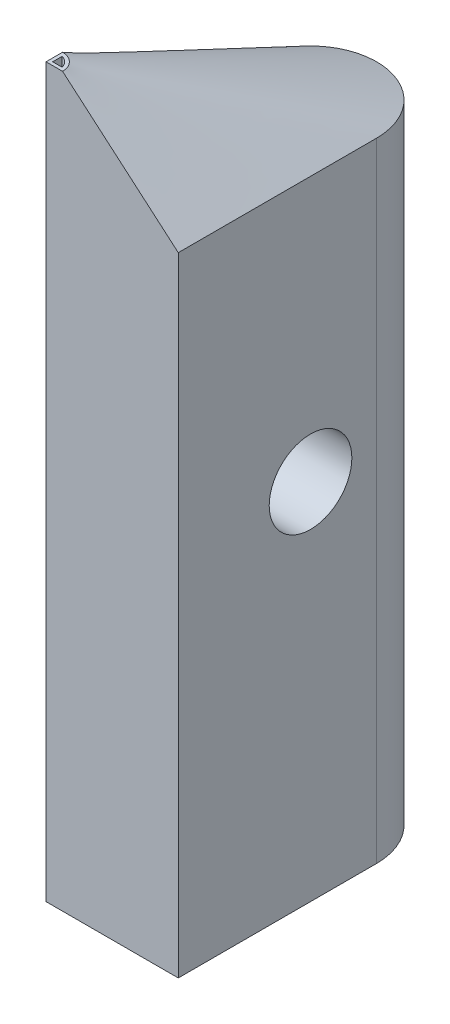
ISO-10303-21;
HEADER;
FILE_DESCRIPTION(('STEP AP214'),'2;1');
FILE_NAME('part.step','',(''),(''),'','','');
FILE_SCHEMA(('AUTOMOTIVE_DESIGN { 1 0 10303 214 1 1 1 1 }'));
ENDSEC;
DATA;
#1=APPLICATION_CONTEXT('core data for automotive mechanical design processes');
#2=APPLICATION_PROTOCOL_DEFINITION('international standard','automotive_design',2000,#1);
#3=PRODUCT_CONTEXT('',#1,'mechanical');
#4=PRODUCT('Part','Part','',(#3));
#5=PRODUCT_RELATED_PRODUCT_CATEGORY('part','',(#4));
#6=PRODUCT_DEFINITION_FORMATION('','',#4);
#7=PRODUCT_DEFINITION_CONTEXT('part definition',#1,'design');
#8=PRODUCT_DEFINITION('design','',#6,#7);
#9=PRODUCT_DEFINITION_SHAPE('','',#8);
#10=(LENGTH_UNIT() NAMED_UNIT(*) SI_UNIT(.MILLI.,.METRE.));
#11=(NAMED_UNIT(*) PLANE_ANGLE_UNIT() SI_UNIT($,.RADIAN.));
#12=(NAMED_UNIT(*) SI_UNIT($,.STERADIAN.) SOLID_ANGLE_UNIT());
#13=UNCERTAINTY_MEASURE_WITH_UNIT(LENGTH_MEASURE(1.E-05),#10,'distance_accuracy_value','');
#14=(GEOMETRIC_REPRESENTATION_CONTEXT(3) GLOBAL_UNCERTAINTY_ASSIGNED_CONTEXT((#13)) GLOBAL_UNIT_ASSIGNED_CONTEXT((#10,
#11,#12)) REPRESENTATION_CONTEXT('',''));
#15=CARTESIAN_POINT('',(0.,0.,0.));
#16=DIRECTION('',(0.,0.,1.));
#17=DIRECTION('',(1.,0.,0.));
#18=AXIS2_PLACEMENT_3D('',#15,#16,#17);
#19=CARTESIAN_POINT('',(-20.,170.,60.));
#20=DIRECTION('',(0.,-1.,0.));
#21=DIRECTION('',(0.,0.,-1.));
#22=AXIS2_PLACEMENT_3D('',#19,#20,#21);
#23=PLANE('',#22);
#24=DIRECTION('',(0.,0.,-1.));
#25=VECTOR('',#24,1.);
#26=CARTESIAN_POINT('',(-20.,170.,60.));
#27=LINE('',#26,#25);
#28=CARTESIAN_POINT('',(-20.,170.,60.));
#29=VERTEX_POINT('',#28);
#30=CARTESIAN_POINT('',(-20.,170.,55.));
#31=VERTEX_POINT('',#30);
#32=EDGE_CURVE('E273',#29,#31,#27,.T.);
#33=ORIENTED_EDGE('',*,*,#32,.F.);
#34=DIRECTION('',(1.,0.,0.));
#35=VECTOR('',#34,1.);
#36=CARTESIAN_POINT('',(-20.,170.,60.));
#37=LINE('',#36,#35);
#38=CARTESIAN_POINT('',(-15.,170.,60.));
#39=VERTEX_POINT('',#38);
#40=EDGE_CURVE('E147',#29,#39,#37,.T.);
#41=ORIENTED_EDGE('',*,*,#40,.T.);
#42=CARTESIAN_POINT('',(-20.,170.,60.));
#43=DIRECTION('',(0.,-1.,0.));
#44=DIRECTION('',(0.,0.,-1.));
#45=AXIS2_PLACEMENT_3D('',#42,#43,#44);
#46=CIRCLE('',#45,5.);
#47=CARTESIAN_POINT('',(-15.9549150281253,170.,57.0610737385376));
#48=VERTEX_POINT('',#47);
#49=EDGE_CURVE('E260',#48,#39,#46,.T.);
#50=ORIENTED_EDGE('',*,*,#49,.F.);
#51=EDGE_CURVE('E261',#31,#48,#46,.T.);
#52=ORIENTED_EDGE('',*,*,#51,.F.);
#53=EDGE_LOOP('',(#33,#41,#50,#52));
#54=FACE_BOUND('',#53,.T.);
#55=DIRECTION('',(0.,0.,-1.));
#56=VECTOR('',#55,1.);
#57=CARTESIAN_POINT('',(-19.,170.,0.));
#58=LINE('',#57,#56);
#59=CARTESIAN_POINT('',(-19.,170.,59.));
#60=VERTEX_POINT('',#59);
#61=CARTESIAN_POINT('',(-19.,170.,56.1270166537926));
#62=VERTEX_POINT('',#61);
#63=EDGE_CURVE('E93',#60,#62,#58,.T.);
#64=ORIENTED_EDGE('',*,*,#63,.T.);
#65=CARTESIAN_POINT('',(-20.,170.,60.));
#66=DIRECTION('',(0.,-1.,0.));
#67=DIRECTION('',(0.,0.,-1.));
#68=AXIS2_PLACEMENT_3D('',#65,#66,#67);
#69=CIRCLE('',#68,4.);
#70=CARTESIAN_POINT('',(-16.1270166537926,170.,59.));
#71=VERTEX_POINT('',#70);
#72=EDGE_CURVE('E332',#62,#71,#69,.T.);
#73=ORIENTED_EDGE('',*,*,#72,.T.);
#74=DIRECTION('',(1.,0.,0.));
#75=VECTOR('',#74,1.);
#76=CARTESIAN_POINT('',(0.,170.,59.));
#77=LINE('',#76,#75);
#78=EDGE_CURVE('E328',#60,#71,#77,.T.);
#79=ORIENTED_EDGE('',*,*,#78,.F.);
#80=EDGE_LOOP('',(#64,#73,#79));
#81=FACE_BOUND('',#80,.T.);
#82=ADVANCED_FACE('F75',(#54,#81),#23,.F.);
#83=CARTESIAN_POINT('',(0.,-50.,0.));
#84=DIRECTION('',(0.,1.,0.));
#85=DIRECTION('',(0.,0.,1.));
#86=AXIS2_PLACEMENT_3D('',#83,#84,#85);
#87=CYLINDRICAL_SURFACE('',#86,20.);
#88=DIRECTION('',(0.,1.,0.));
#89=VECTOR('',#88,1.);
#90=CARTESIAN_POINT('',(-20.,-50.,0.));
#91=LINE('',#90,#89);
#92=CARTESIAN_POINT('',(-20.,-50.,0.));
#93=VERTEX_POINT('',#92);
#94=CARTESIAN_POINT('',(-20.,140.,0.));
#95=VERTEX_POINT('',#94);
#96=EDGE_CURVE('E122',#93,#95,#91,.T.);
#97=ORIENTED_EDGE('',*,*,#96,.T.);
#98=CARTESIAN_POINT('',(20.,140.,60.));
#99=CARTESIAN_POINT('',(20.,140.,55.4019407833369));
#100=CARTESIAN_POINT('',(20.,140.,45.6811972447143));
#101=CARTESIAN_POINT('',(20.,140.,30.));
#102=CARTESIAN_POINT('',(20.,140.,14.3188027552857));
#103=CARTESIAN_POINT('',(20.,140.,4.59805921666312));
#104=CARTESIAN_POINT('',(20.,140.,-2.81896424716483));
#105=CARTESIAN_POINT('',(18.8035920170639,140.,-8.27180270953886));
#106=CARTESIAN_POINT('',(14.170791174395,140.,-14.8236236418117));
#107=CARTESIAN_POINT('',(7.58359128178384,140.,-19.0344797939609));
#108=CARTESIAN_POINT('',(0.,139.999999999999,-20.4832389037656));
#109=CARTESIAN_POINT('',(-7.58359128178385,140.,-19.034479793961));
#110=CARTESIAN_POINT('',(-14.170791174395,140.,-14.8236236418116));
#111=CARTESIAN_POINT('',(-18.8035920170639,140.,-8.27180270953888));
#112=CARTESIAN_POINT('',(-20.,140.,-2.81896424716483));
#113=CARTESIAN_POINT('',(-20.,140.,0.));
#114=B_SPLINE_CURVE_WITH_KNOTS('',3,(#98,#99,#100,#101,#102,#103,#104,#105,#106,#107,#108,#109,
#110,#111,#112,#113),.UNSPECIFIED.,.F.,.F.,(4,1,1,1,2,1,1,1,1,1,1,1,4),(0.,0.1123013070716,
0.224602614143199,0.336903921214799,0.449205228286398,0.518054574750598,0.586903921214799,
0.655753267678999,0.724602614143199,0.7934519606074,0.8623013070716,0.9311506535358,1.),.UNSPECIFIED.);
#115=CARTESIAN_POINT('',(20.,140.,0.));
#116=VERTEX_POINT('',#115);
#117=EDGE_CURVE('E158',#116,#95,#114,.T.);
#118=ORIENTED_EDGE('',*,*,#117,.F.);
#119=DIRECTION('',(0.,1.,0.));
#120=VECTOR('',#119,1.);
#121=CARTESIAN_POINT('',(20.,-50.,0.));
#122=LINE('',#121,#120);
#123=CARTESIAN_POINT('',(20.,-50.,0.));
#124=VERTEX_POINT('',#123);
#125=EDGE_CURVE('E12',#124,#116,#122,.T.);
#126=ORIENTED_EDGE('',*,*,#125,.F.);
#127=CARTESIAN_POINT('',(0.,-50.,0.));
#128=DIRECTION('',(0.,1.,0.));
#129=DIRECTION('',(0.,0.,-1.));
#130=AXIS2_PLACEMENT_3D('',#127,#128,#129);
#131=CIRCLE('',#130,20.);
#132=EDGE_CURVE('E143',#124,#93,#131,.T.);
#133=ORIENTED_EDGE('',*,*,#132,.T.);
#134=EDGE_LOOP('',(#97,#118,#126,#133));
#135=FACE_BOUND('',#134,.T.);
#136=ADVANCED_FACE('F77',(#135),#87,.T.);
#137=CARTESIAN_POINT('',(20.,-50.,20.));
#138=DIRECTION('',(1.,0.,0.));
#139=DIRECTION('',(0.,0.,-1.));
#140=AXIS2_PLACEMENT_3D('',#137,#138,#139);
#141=PLANE('',#140);
#142=CARTESIAN_POINT('',(20.,60.,20.));
#143=DIRECTION('',(1.,0.,0.));
#144=DIRECTION('',(0.,0.,-1.));
#145=AXIS2_PLACEMENT_3D('',#142,#143,#144);
#146=CIRCLE('',#145,12.5);
#147=CARTESIAN_POINT('',(20.,60.,7.50000000000001));
#148=VERTEX_POINT('',#147);
#149=EDGE_CURVE('E204',#148,#148,#146,.F.);
#150=ORIENTED_EDGE('',*,*,#149,.T.);
#151=EDGE_LOOP('',(#150));
#152=FACE_BOUND('',#151,.T.);
#153=ORIENTED_EDGE('',*,*,#125,.T.);
#154=DIRECTION('',(0.,0.,-1.));
#155=VECTOR('',#154,1.);
#156=CARTESIAN_POINT('',(20.,140.,20.));
#157=LINE('',#156,#155);
#158=CARTESIAN_POINT('',(20.,140.,60.));
#159=VERTEX_POINT('',#158);
#160=EDGE_CURVE('E195',#159,#116,#157,.T.);
#161=ORIENTED_EDGE('',*,*,#160,.F.);
#162=DIRECTION('',(0.,1.,0.));
#163=VECTOR('',#162,1.);
#164=CARTESIAN_POINT('',(20.,-50.,60.));
#165=LINE('',#164,#163);
#166=CARTESIAN_POINT('',(20.,-50.,60.));
#167=VERTEX_POINT('',#166);
#168=EDGE_CURVE('E85',#167,#159,#165,.T.);
#169=ORIENTED_EDGE('',*,*,#168,.F.);
#170=DIRECTION('',(0.,0.,-1.));
#171=VECTOR('',#170,1.);
#172=CARTESIAN_POINT('',(20.,-50.,60.));
#173=LINE('',#172,#171);
#174=EDGE_CURVE('E101',#167,#124,#173,.T.);
#175=ORIENTED_EDGE('',*,*,#174,.T.);
#176=EDGE_LOOP('',(#153,#161,#169,#175));
#177=FACE_BOUND('',#176,.T.);
#178=ADVANCED_FACE('F188',(#152,#177),#141,.T.);
#179=CARTESIAN_POINT('',(-20.,-50.,60.));
#180=DIRECTION('',(0.,0.,1.));
#181=DIRECTION('',(1.,0.,0.));
#182=AXIS2_PLACEMENT_3D('',#179,#180,#181);
#183=PLANE('',#182);
#184=ORIENTED_EDGE('',*,*,#168,.T.);
#185=DIRECTION('',(-0.759256602365297,0.650791373455968,0.));
#186=VECTOR('',#185,1.);
#187=CARTESIAN_POINT('',(2.5,155.,60.));
#188=LINE('',#187,#186);
#189=EDGE_CURVE('E279',#159,#39,#188,.T.);
#190=ORIENTED_EDGE('',*,*,#189,.T.);
#191=ORIENTED_EDGE('',*,*,#40,.F.);
#192=DIRECTION('',(0.,1.,0.));
#193=VECTOR('',#192,1.);
#194=CARTESIAN_POINT('',(-20.,-50.,60.));
#195=LINE('',#194,#193);
#196=CARTESIAN_POINT('',(-20.,-50.,60.));
#197=VERTEX_POINT('',#196);
#198=EDGE_CURVE('E136',#197,#29,#195,.T.);
#199=ORIENTED_EDGE('',*,*,#198,.F.);
#200=DIRECTION('',(1.,0.,0.));
#201=VECTOR('',#200,1.);
#202=CARTESIAN_POINT('',(-20.,-50.,60.));
#203=LINE('',#202,#201);
#204=EDGE_CURVE('E142',#197,#167,#203,.T.);
#205=ORIENTED_EDGE('',*,*,#204,.T.);
#206=EDGE_LOOP('',(#184,#190,#191,#199,#205));
#207=FACE_BOUND('',#206,.T.);
#208=ADVANCED_FACE('F145',(#207),#183,.T.);
#209=CARTESIAN_POINT('',(-20.,-50.,20.));
#210=DIRECTION('',(-1.,0.,0.));
#211=DIRECTION('',(0.,0.,1.));
#212=AXIS2_PLACEMENT_3D('',#209,#210,#211);
#213=PLANE('',#212);
#214=CARTESIAN_POINT('',(-20.,60.,20.));
#215=DIRECTION('',(-1.,0.,0.));
#216=DIRECTION('',(0.,0.,1.));
#217=AXIS2_PLACEMENT_3D('',#214,#215,#216);
#218=CIRCLE('',#217,12.5);
#219=CARTESIAN_POINT('',(-20.,60.,32.5));
#220=VERTEX_POINT('',#219);
#221=EDGE_CURVE('E208',#220,#220,#218,.T.);
#222=ORIENTED_EDGE('',*,*,#221,.F.);
#223=EDGE_LOOP('',(#222));
#224=FACE_BOUND('',#223,.T.);
#225=ORIENTED_EDGE('',*,*,#198,.T.);
#226=ORIENTED_EDGE('',*,*,#32,.T.);
#227=DIRECTION('',(0.,0.478852130680573,0.877895572914385));
#228=VECTOR('',#227,1.);
#229=CARTESIAN_POINT('',(-20.,155.,27.5));
#230=LINE('',#229,#228);
#231=EDGE_CURVE('E278',#95,#31,#230,.T.);
#232=ORIENTED_EDGE('',*,*,#231,.F.);
#233=ORIENTED_EDGE('',*,*,#96,.F.);
#234=DIRECTION('',(0.,0.,1.));
#235=VECTOR('',#234,1.);
#236=CARTESIAN_POINT('',(-20.,-50.,0.));
#237=LINE('',#236,#235);
#238=EDGE_CURVE('E132',#93,#197,#237,.T.);
#239=ORIENTED_EDGE('',*,*,#238,.T.);
#240=EDGE_LOOP('',(#225,#226,#232,#233,#239));
#241=FACE_BOUND('',#240,.T.);
#242=ADVANCED_FACE('F134',(#224,#241),#213,.T.);
#243=CARTESIAN_POINT('',(0.,-50.,0.));
#244=DIRECTION('',(0.,-1.,0.));
#245=DIRECTION('',(0.,0.,-1.));
#246=AXIS2_PLACEMENT_3D('',#243,#244,#245);
#247=PLANE('',#246);
#248=ORIENTED_EDGE('',*,*,#132,.F.);
#249=ORIENTED_EDGE('',*,*,#174,.F.);
#250=ORIENTED_EDGE('',*,*,#204,.F.);
#251=ORIENTED_EDGE('',*,*,#238,.F.);
#252=EDGE_LOOP('',(#248,#249,#250,#251));
#253=FACE_BOUND('',#252,.T.);
#254=ADVANCED_FACE('F151',(#253),#247,.T.);
#255=CARTESIAN_POINT('',(55.3553390593274,60.,20.));
#256=DIRECTION('',(-1.,0.,0.));
#257=DIRECTION('',(0.,0.,1.));
#258=AXIS2_PLACEMENT_3D('',#255,#256,#257);
#259=CYLINDRICAL_SURFACE('',#258,12.5);
#260=ORIENTED_EDGE('',*,*,#221,.T.);
#261=EDGE_LOOP('',(#260));
#262=FACE_BOUND('',#261,.T.);
#263=ORIENTED_EDGE('',*,*,#149,.F.);
#264=EDGE_LOOP('',(#263));
#265=FACE_BOUND('',#264,.T.);
#266=ADVANCED_FACE('F235',(#262,#265),#259,.F.);
#267=CARTESIAN_POINT('',(20.,140.,60.));
#268=CARTESIAN_POINT('',(-15.,170.,60.));
#269=CARTESIAN_POINT('',(20.,140.,55.4019407833369));
#270=CARTESIAN_POINT('',(-15.,170.,59.7059958680896));
#271=CARTESIAN_POINT('',(20.,140.,45.6811972447143));
#272=CARTESIAN_POINT('',(-15.0495267687466,170.,59.1746297244077));
#273=CARTESIAN_POINT('',(20.,140.,30.));
#274=CARTESIAN_POINT('',(-15.2271344449601,170.,58.4492019736959));
#275=CARTESIAN_POINT('',(20.,140.,14.3188027552857));
#276=CARTESIAN_POINT('',(-15.509842550044,170.,57.7579234224067));
#277=CARTESIAN_POINT('',(20.,140.,4.59805921666312));
#278=CARTESIAN_POINT('',(-15.7821037352753,170.,57.2989280776695));
#279=CARTESIAN_POINT('',(20.,140.,-2.81896424716483));
#280=CARTESIAN_POINT('',(-16.0608616541299,170.,56.91525071797));
#281=CARTESIAN_POINT('',(18.8035920170639,140.,-8.27180270953886));
#282=CARTESIAN_POINT('',(-16.2949448790564,170.,56.626492280199));
#283=CARTESIAN_POINT('',(14.170791174395,140.,-14.8236236418117));
#284=CARTESIAN_POINT('',(-16.7116021654231,170.,56.2174361013872));
#285=CARTESIAN_POINT('',(7.58359128178384,140.,-19.0344797939609));
#286=CARTESIAN_POINT('',(-17.1927544309923,170.,55.8478800681714));
#287=CARTESIAN_POINT('',(0.,139.999999999999,-20.4832389037656));
#288=CARTESIAN_POINT('',(-17.7239961902029,170.,55.5330910123224));
#289=CARTESIAN_POINT('',(-7.58359128178385,140.,-19.034479793961));
#290=CARTESIAN_POINT('',(-18.2909219574939,170.,55.2883357656105));
#291=CARTESIAN_POINT('',(-14.170791174395,140.,-14.8236236418116));
#292=CARTESIAN_POINT('',(-18.8727132745479,170.,55.116294992103));
#293=CARTESIAN_POINT('',(-18.8035920170639,140.,-8.27180270953888));
#294=CARTESIAN_POINT('',(-19.4485516830473,170.,55.0196493558668));
#295=CARTESIAN_POINT('',(-20.,140.,-2.81896424716483));
#296=CARTESIAN_POINT('',(-19.819752833894,170.,55.));
#297=CARTESIAN_POINT('',(-20.,140.,0.));
#298=CARTESIAN_POINT('',(-20.,170.,55.));
#299=B_SPLINE_SURFACE_WITH_KNOTS('',3,1,((#267,#268),(#269,#270),(#271,#272),(#273,#274),(#275,
#276),(#277,#278),(#279,#280),(#281,#282),(#283,#284),(#285,#286),(#287,#288),(#289,#290),(#291,
#292),(#293,#294),(#295,#296),(#297,#298)),.UNSPECIFIED.,.F.,.F.,.F.,(4,1,1,1,2,1,1,1,1,1,1,1,
4),(2,2),(0.,0.1123013070716,0.224602614143199,0.336903921214799,0.449205228286398,
0.518054574750598,0.586903921214799,0.655753267678999,0.724602614143199,0.7934519606074,
0.8623013070716,0.9311506535358,1.),(0.,1.),.UNSPECIFIED.);
#300=ORIENTED_EDGE('',*,*,#160,.T.);
#301=ORIENTED_EDGE('',*,*,#117,.T.);
#302=ORIENTED_EDGE('',*,*,#231,.T.);
#303=ORIENTED_EDGE('',*,*,#51,.T.);
#304=ORIENTED_EDGE('',*,*,#49,.T.);
#305=ORIENTED_EDGE('',*,*,#189,.F.);
#306=EDGE_LOOP('',(#300,#301,#302,#303,#304,#305));
#307=FACE_BOUND('',#306,.T.);
#308=ADVANCED_FACE('F230',(#307),#299,.T.);
#309=CARTESIAN_POINT('',(-19.,165.,0.));
#310=DIRECTION('',(1.,0.,0.));
#311=DIRECTION('',(0.,0.,-1.));
#312=AXIS2_PLACEMENT_3D('',#309,#310,#311);
#313=PLANE('',#312);
#314=ORIENTED_EDGE('',*,*,#63,.F.);
#315=DIRECTION('',(0.,1.,0.));
#316=VECTOR('',#315,1.);
#317=CARTESIAN_POINT('',(-19.,165.,59.));
#318=LINE('',#317,#316);
#319=CARTESIAN_POINT('',(-19.,165.,59.));
#320=VERTEX_POINT('',#319);
#321=EDGE_CURVE('E327',#320,#60,#318,.T.);
#322=ORIENTED_EDGE('',*,*,#321,.F.);
#323=DIRECTION('',(0.,0.,-1.));
#324=VECTOR('',#323,1.);
#325=CARTESIAN_POINT('',(-19.,165.,0.));
#326=LINE('',#325,#324);
#327=CARTESIAN_POINT('',(-19.,165.,56.1270166537926));
#328=VERTEX_POINT('',#327);
#329=EDGE_CURVE('E319',#320,#328,#326,.T.);
#330=ORIENTED_EDGE('',*,*,#329,.T.);
#331=DIRECTION('',(0.,1.,0.));
#332=VECTOR('',#331,1.);
#333=CARTESIAN_POINT('',(-19.,165.,56.1270166537926));
#334=LINE('',#333,#332);
#335=EDGE_CURVE('E281',#328,#62,#334,.T.);
#336=ORIENTED_EDGE('',*,*,#335,.T.);
#337=EDGE_LOOP('',(#314,#322,#330,#336));
#338=FACE_BOUND('',#337,.T.);
#339=ADVANCED_FACE('F326',(#338),#313,.T.);
#340=CARTESIAN_POINT('',(-20.,165.,60.));
#341=DIRECTION('',(0.,1.,0.));
#342=DIRECTION('',(0.,0.,1.));
#343=AXIS2_PLACEMENT_3D('',#340,#341,#342);
#344=CYLINDRICAL_SURFACE('',#343,4.);
#345=ORIENTED_EDGE('',*,*,#72,.F.);
#346=ORIENTED_EDGE('',*,*,#335,.F.);
#347=CARTESIAN_POINT('',(-20.,165.,60.));
#348=DIRECTION('',(0.,-1.,0.));
#349=DIRECTION('',(0.,0.,-1.));
#350=AXIS2_PLACEMENT_3D('',#347,#348,#349);
#351=CIRCLE('',#350,4.);
#352=CARTESIAN_POINT('',(-16.1270166537926,165.,59.));
#353=VERTEX_POINT('',#352);
#354=EDGE_CURVE('E316',#328,#353,#351,.T.);
#355=ORIENTED_EDGE('',*,*,#354,.T.);
#356=DIRECTION('',(0.,1.,0.));
#357=VECTOR('',#356,1.);
#358=CARTESIAN_POINT('',(-16.1270166537926,165.,59.));
#359=LINE('',#358,#357);
#360=EDGE_CURVE('E333',#353,#71,#359,.T.);
#361=ORIENTED_EDGE('',*,*,#360,.T.);
#362=EDGE_LOOP('',(#345,#346,#355,#361));
#363=FACE_BOUND('',#362,.T.);
#364=ADVANCED_FACE('F330',(#363),#344,.F.);
#365=CARTESIAN_POINT('',(0.,165.,59.));
#366=DIRECTION('',(0.,0.,1.));
#367=DIRECTION('',(1.,0.,0.));
#368=AXIS2_PLACEMENT_3D('',#365,#366,#367);
#369=PLANE('',#368);
#370=ORIENTED_EDGE('',*,*,#78,.T.);
#371=ORIENTED_EDGE('',*,*,#360,.F.);
#372=DIRECTION('',(1.,0.,0.));
#373=VECTOR('',#372,1.);
#374=CARTESIAN_POINT('',(0.,165.,59.));
#375=LINE('',#374,#373);
#376=EDGE_CURVE('E321',#320,#353,#375,.T.);
#377=ORIENTED_EDGE('',*,*,#376,.F.);
#378=ORIENTED_EDGE('',*,*,#321,.T.);
#379=EDGE_LOOP('',(#370,#371,#377,#378));
#380=FACE_BOUND('',#379,.T.);
#381=ADVANCED_FACE('F346',(#380),#369,.F.);
#382=CARTESIAN_POINT('',(0.,165.,0.));
#383=DIRECTION('',(0.,-1.,0.));
#384=DIRECTION('',(0.,0.,-1.));
#385=AXIS2_PLACEMENT_3D('',#382,#383,#384);
#386=PLANE('',#385);
#387=ORIENTED_EDGE('',*,*,#329,.F.);
#388=ORIENTED_EDGE('',*,*,#376,.T.);
#389=ORIENTED_EDGE('',*,*,#354,.F.);
#390=EDGE_LOOP('',(#387,#388,#389));
#391=FACE_BOUND('',#390,.T.);
#392=ADVANCED_FACE('F318',(#391),#386,.F.);
#393=CLOSED_SHELL('',(#82,#136,#178,#208,#242,#254,#266,#308,#339,#364,#381,#392));
#394=MANIFOLD_SOLID_BREP('B2',#393);
#395=ADVANCED_BREP_SHAPE_REPRESENTATION('',(#18,#394),#14);
#396=SHAPE_DEFINITION_REPRESENTATION(#9,#395);
ENDSEC;
END-ISO-10303-21;
